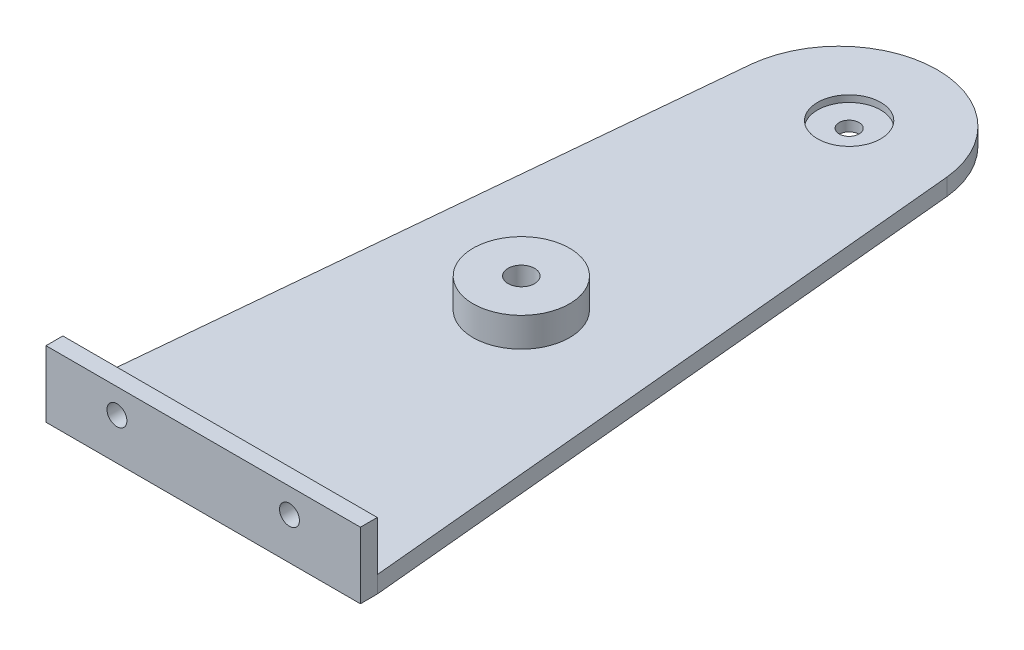
ISO-10303-21;
HEADER;
FILE_DESCRIPTION(('STEP AP214'),'2;1');
FILE_NAME('part.step','',(''),(''),'','','');
FILE_SCHEMA(('AUTOMOTIVE_DESIGN { 1 0 10303 214 1 1 1 1 }'));
ENDSEC;
DATA;
#1=APPLICATION_CONTEXT('core data for automotive mechanical design processes');
#2=APPLICATION_PROTOCOL_DEFINITION('international standard','automotive_design',2000,#1);
#3=PRODUCT_CONTEXT('',#1,'mechanical');
#4=PRODUCT('Part','Part','',(#3));
#5=PRODUCT_RELATED_PRODUCT_CATEGORY('part','',(#4));
#6=PRODUCT_DEFINITION_FORMATION('','',#4);
#7=PRODUCT_DEFINITION_CONTEXT('part definition',#1,'design');
#8=PRODUCT_DEFINITION('design','',#6,#7);
#9=PRODUCT_DEFINITION_SHAPE('','',#8);
#10=(LENGTH_UNIT() NAMED_UNIT(*) SI_UNIT(.MILLI.,.METRE.));
#11=(NAMED_UNIT(*) PLANE_ANGLE_UNIT() SI_UNIT($,.RADIAN.));
#12=(NAMED_UNIT(*) SI_UNIT($,.STERADIAN.) SOLID_ANGLE_UNIT());
#13=UNCERTAINTY_MEASURE_WITH_UNIT(LENGTH_MEASURE(1.E-05),#10,'distance_accuracy_value','');
#14=(GEOMETRIC_REPRESENTATION_CONTEXT(3) GLOBAL_UNCERTAINTY_ASSIGNED_CONTEXT((#13)) GLOBAL_UNIT_ASSIGNED_CONTEXT((#10,
#11,#12)) REPRESENTATION_CONTEXT('',''));
#15=CARTESIAN_POINT('',(0.,0.,0.));
#16=DIRECTION('',(0.,0.,1.));
#17=DIRECTION('',(1.,0.,0.));
#18=AXIS2_PLACEMENT_3D('',#15,#16,#17);
#19=CARTESIAN_POINT('',(0.,0.,0.));
#20=DIRECTION('',(0.,1.,0.));
#21=DIRECTION('',(0.,0.,1.));
#22=AXIS2_PLACEMENT_3D('',#19,#20,#21);
#23=PLANE('',#22);
#24=CARTESIAN_POINT('',(-0.0202063432006589,0.,49.3982763451399));
#25=DIRECTION('',(0.,1.,0.));
#26=DIRECTION('',(0.,0.,1.));
#27=AXIS2_PLACEMENT_3D('',#24,#25,#26);
#28=CIRCLE('',#27,7.26796940156826);
#29=CARTESIAN_POINT('',(-0.0202063432006589,0.,56.6662457467081));
#30=VERTEX_POINT('',#29);
#31=EDGE_CURVE('E11',#30,#30,#28,.T.);
#32=ORIENTED_EDGE('',*,*,#31,.F.);
#33=EDGE_LOOP('',(#32));
#34=FACE_BOUND('',#33,.T.);
#35=DIRECTION('',(0.0941057343410475,0.,0.995562208384856));
#36=VECTOR('',#35,1.);
#37=CARTESIAN_POINT('',(14.5881691243835,0.,-1.37894986026911));
#38=LINE('',#37,#36);
#39=CARTESIAN_POINT('',(14.7185146599283,0.,0.));
#40=VERTEX_POINT('',#39);
#41=CARTESIAN_POINT('',(23.6803571196277,0.,94.8090117233565));
#42=VERTEX_POINT('',#41);
#43=EDGE_CURVE('E125',#40,#42,#38,.T.);
#44=ORIENTED_EDGE('',*,*,#43,.F.);
#45=CARTESIAN_POINT('',(-0.0202063432006572,0.,1.53641351594778));
#46=DIRECTION('',(0.,1.,0.));
#47=DIRECTION('',(0.,0.,1.));
#48=AXIS2_PLACEMENT_3D('',#45,#46,#47);
#49=CIRCLE('',#48,14.8185850640357);
#50=CARTESIAN_POINT('',(-14.7589273463297,0.,0.));
#51=VERTEX_POINT('',#50);
#52=EDGE_CURVE('E127',#40,#51,#49,.T.);
#53=ORIENTED_EDGE('',*,*,#52,.T.);
#54=DIRECTION('',(-0.0938954260904472,0.,0.995582065406611));
#55=VECTOR('',#54,1.);
#56=CARTESIAN_POINT('',(-14.6288074618601,0.,-1.37967341674187));
#57=LINE('',#56,#55);
#58=CARTESIAN_POINT('',(-23.700563462829,0.,94.8090117233565));
#59=VERTEX_POINT('',#58);
#60=EDGE_CURVE('E143',#51,#59,#57,.T.);
#61=ORIENTED_EDGE('',*,*,#60,.T.);
#62=DIRECTION('',(-1.,0.,0.));
#63=VECTOR('',#62,1.);
#64=CARTESIAN_POINT('',(0.,0.,94.8090117233565));
#65=LINE('',#64,#63);
#66=EDGE_CURVE('E75',#42,#59,#65,.T.);
#67=ORIENTED_EDGE('',*,*,#66,.F.);
#68=EDGE_LOOP('',(#44,#53,#61,#67));
#69=FACE_BOUND('',#68,.T.);
#70=CARTESIAN_POINT('',(-0.0202063432006589,0.,0.));
#71=DIRECTION('',(0.,1.,0.));
#72=DIRECTION('',(0.,0.,1.));
#73=AXIS2_PLACEMENT_3D('',#70,#71,#72);
#74=CIRCLE('',#73,4.7625);
#75=CARTESIAN_POINT('',(-0.0202063432006589,0.,4.76250000000003));
#76=VERTEX_POINT('',#75);
#77=EDGE_CURVE('E228',#76,#76,#74,.F.);
#78=ORIENTED_EDGE('',*,*,#77,.T.);
#79=EDGE_LOOP('',(#78));
#80=FACE_BOUND('',#79,.T.);
#81=ADVANCED_FACE('F34',(#34,#69,#80),#23,.T.);
#82=CARTESIAN_POINT('',(-0.0202063432006589,-10.,0.));
#83=DIRECTION('',(0.,1.,0.));
#84=DIRECTION('',(0.,0.,1.));
#85=AXIS2_PLACEMENT_3D('',#82,#83,#84);
#86=CYLINDRICAL_SURFACE('',#85,1.5);
#87=CARTESIAN_POINT('',(-0.0202063432006589,-2.54,0.));
#88=DIRECTION('',(0.,1.,0.));
#89=DIRECTION('',(0.,0.,1.));
#90=AXIS2_PLACEMENT_3D('',#87,#88,#89);
#91=CIRCLE('',#90,1.5);
#92=CARTESIAN_POINT('',(-0.0202063432006589,-2.54,1.50000000000003));
#93=VERTEX_POINT('',#92);
#94=EDGE_CURVE('E239',#93,#93,#91,.F.);
#95=ORIENTED_EDGE('',*,*,#94,.T.);
#96=EDGE_LOOP('',(#95));
#97=FACE_BOUND('',#96,.T.);
#98=CARTESIAN_POINT('',(-0.0202063432006589,-1.,0.));
#99=DIRECTION('',(0.,1.,0.));
#100=DIRECTION('',(0.,0.,1.));
#101=AXIS2_PLACEMENT_3D('',#98,#99,#100);
#102=CIRCLE('',#101,1.5);
#103=CARTESIAN_POINT('',(-0.0202063432006589,-1.,1.50000000000003));
#104=VERTEX_POINT('',#103);
#105=EDGE_CURVE('E237',#104,#104,#102,.F.);
#106=ORIENTED_EDGE('',*,*,#105,.F.);
#107=EDGE_LOOP('',(#106));
#108=FACE_BOUND('',#107,.T.);
#109=ADVANCED_FACE('F166',(#97,#108),#86,.F.);
#110=CARTESIAN_POINT('',(14.5881691243835,-2.54,-1.37894986026911));
#111=DIRECTION('',(-0.995562208384856,0.,0.0941057343410474));
#112=DIRECTION('',(0.0941057343410475,0.,0.995562208384857));
#113=AXIS2_PLACEMENT_3D('',#110,#111,#112);
#114=PLANE('',#113);
#115=ORIENTED_EDGE('',*,*,#43,.T.);
#116=DIRECTION('',(0.,1.,0.));
#117=VECTOR('',#116,1.);
#118=CARTESIAN_POINT('',(23.6803571196277,-2.54,94.8090117233565));
#119=LINE('',#118,#117);
#120=CARTESIAN_POINT('',(23.6803571196277,-2.54,94.8090117233565));
#121=VERTEX_POINT('',#120);
#122=EDGE_CURVE('E43',#121,#42,#119,.T.);
#123=ORIENTED_EDGE('',*,*,#122,.F.);
#124=DIRECTION('',(0.0941057343410475,0.,0.995562208384856));
#125=VECTOR('',#124,1.);
#126=CARTESIAN_POINT('',(14.5881691243835,-2.54,-1.37894986026911));
#127=LINE('',#126,#125);
#128=CARTESIAN_POINT('',(14.7185146599283,-2.54,0.));
#129=VERTEX_POINT('',#128);
#130=EDGE_CURVE('E51',#129,#121,#127,.T.);
#131=ORIENTED_EDGE('',*,*,#130,.F.);
#132=DIRECTION('',(0.,1.,0.));
#133=VECTOR('',#132,1.);
#134=CARTESIAN_POINT('',(14.7185146599283,-2.54,0.));
#135=LINE('',#134,#133);
#136=EDGE_CURVE('E79',#129,#40,#135,.T.);
#137=ORIENTED_EDGE('',*,*,#136,.T.);
#138=EDGE_LOOP('',(#115,#123,#131,#137));
#139=FACE_BOUND('',#138,.T.);
#140=ADVANCED_FACE('F36',(#139),#114,.F.);
#141=CARTESIAN_POINT('',(-14.6288074618601,-2.54,-1.37967341674187));
#142=DIRECTION('',(-0.995582065406611,0.,-0.0938954260904472));
#143=DIRECTION('',(-0.0938954260904472,0.,0.995582065406611));
#144=AXIS2_PLACEMENT_3D('',#141,#142,#143);
#145=PLANE('',#144);
#146=ORIENTED_EDGE('',*,*,#60,.F.);
#147=DIRECTION('',(0.,1.,0.));
#148=VECTOR('',#147,1.);
#149=CARTESIAN_POINT('',(-14.7589273463297,-2.54,0.));
#150=LINE('',#149,#148);
#151=CARTESIAN_POINT('',(-14.7589273463297,-2.54,0.));
#152=VERTEX_POINT('',#151);
#153=EDGE_CURVE('E67',#152,#51,#150,.T.);
#154=ORIENTED_EDGE('',*,*,#153,.F.);
#155=DIRECTION('',(-0.0938954260904472,0.,0.995582065406611));
#156=VECTOR('',#155,1.);
#157=CARTESIAN_POINT('',(-14.6288074618601,-2.54,-1.37967341674187));
#158=LINE('',#157,#156);
#159=CARTESIAN_POINT('',(-23.700563462829,-2.54,94.8090117233565));
#160=VERTEX_POINT('',#159);
#161=EDGE_CURVE('E136',#152,#160,#158,.T.);
#162=ORIENTED_EDGE('',*,*,#161,.T.);
#163=DIRECTION('',(0.,1.,0.));
#164=VECTOR('',#163,1.);
#165=CARTESIAN_POINT('',(-23.700563462829,-2.54,94.8090117233565));
#166=LINE('',#165,#164);
#167=EDGE_CURVE('E147',#160,#59,#166,.T.);
#168=ORIENTED_EDGE('',*,*,#167,.T.);
#169=EDGE_LOOP('',(#146,#154,#162,#168));
#170=FACE_BOUND('',#169,.T.);
#171=ADVANCED_FACE('F156',(#170),#145,.T.);
#172=CARTESIAN_POINT('',(-0.0202063432006572,-2.54,1.53641351594778));
#173=DIRECTION('',(0.,1.,0.));
#174=DIRECTION('',(0.,0.,1.));
#175=AXIS2_PLACEMENT_3D('',#172,#173,#174);
#176=CYLINDRICAL_SURFACE('',#175,14.8185850640357);
#177=ORIENTED_EDGE('',*,*,#52,.F.);
#178=ORIENTED_EDGE('',*,*,#136,.F.);
#179=CARTESIAN_POINT('',(-0.0202063432006572,-2.54,1.53641351594778));
#180=DIRECTION('',(0.,1.,0.));
#181=DIRECTION('',(0.,0.,1.));
#182=AXIS2_PLACEMENT_3D('',#179,#180,#181);
#183=CIRCLE('',#182,14.8185850640357);
#184=EDGE_CURVE('E134',#129,#152,#183,.T.);
#185=ORIENTED_EDGE('',*,*,#184,.T.);
#186=ORIENTED_EDGE('',*,*,#153,.T.);
#187=EDGE_LOOP('',(#177,#178,#185,#186));
#188=FACE_BOUND('',#187,.T.);
#189=ADVANCED_FACE('F153',(#188),#176,.T.);
#190=CARTESIAN_POINT('',(-0.0202063432006589,-2.54,49.3982763451399));
#191=DIRECTION('',(0.,1.,0.));
#192=DIRECTION('',(0.,0.,1.));
#193=AXIS2_PLACEMENT_3D('',#190,#191,#192);
#194=CYLINDRICAL_SURFACE('',#193,1.99999994336487);
#195=CARTESIAN_POINT('',(-0.0202063432006589,-2.54,49.3982763451399));
#196=DIRECTION('',(0.,1.,0.));
#197=DIRECTION('',(0.,0.,1.));
#198=AXIS2_PLACEMENT_3D('',#195,#196,#197);
#199=CIRCLE('',#198,1.99999994336487);
#200=CARTESIAN_POINT('',(-0.0202063432006589,-2.54,51.3982762885047));
#201=VERTEX_POINT('',#200);
#202=EDGE_CURVE('E138',#201,#201,#199,.F.);
#203=ORIENTED_EDGE('',*,*,#202,.T.);
#204=EDGE_LOOP('',(#203));
#205=FACE_BOUND('',#204,.T.);
#206=CARTESIAN_POINT('',(-0.0202063432006589,4.420108,49.3982763451399));
#207=DIRECTION('',(0.,1.,0.));
#208=DIRECTION('',(0.,0.,1.));
#209=AXIS2_PLACEMENT_3D('',#206,#207,#208);
#210=CIRCLE('',#209,1.99999994336487);
#211=CARTESIAN_POINT('',(-0.0202063432006589,4.420108,51.3982762885047));
#212=VERTEX_POINT('',#211);
#213=EDGE_CURVE('E226',#212,#212,#210,.F.);
#214=ORIENTED_EDGE('',*,*,#213,.F.);
#215=EDGE_LOOP('',(#214));
#216=FACE_BOUND('',#215,.T.);
#217=ADVANCED_FACE('F155',(#205,#216),#194,.F.);
#218=CARTESIAN_POINT('',(0.,-2.54,0.));
#219=DIRECTION('',(0.,1.,0.));
#220=DIRECTION('',(0.,0.,1.));
#221=AXIS2_PLACEMENT_3D('',#218,#219,#220);
#222=PLANE('',#221);
#223=ORIENTED_EDGE('',*,*,#94,.F.);
#224=EDGE_LOOP('',(#223));
#225=FACE_BOUND('',#224,.T.);
#226=ORIENTED_EDGE('',*,*,#130,.T.);
#227=DIRECTION('',(0.,0.,-1.));
#228=VECTOR('',#227,1.);
#229=CARTESIAN_POINT('',(23.6803571196277,-2.54,97.3490117233565));
#230=LINE('',#229,#228);
#231=CARTESIAN_POINT('',(23.6803571196277,-2.54,97.3490117233565));
#232=VERTEX_POINT('',#231);
#233=EDGE_CURVE('E106',#232,#121,#230,.T.);
#234=ORIENTED_EDGE('',*,*,#233,.F.);
#235=DIRECTION('',(1.,0.,0.));
#236=VECTOR('',#235,1.);
#237=CARTESIAN_POINT('',(23.6803571196277,-2.54,97.3490117233565));
#238=LINE('',#237,#236);
#239=CARTESIAN_POINT('',(-23.700563462829,-2.54,97.3490117233565));
#240=VERTEX_POINT('',#239);
#241=EDGE_CURVE('E112',#240,#232,#238,.T.);
#242=ORIENTED_EDGE('',*,*,#241,.F.);
#243=DIRECTION('',(0.,0.,-1.));
#244=VECTOR('',#243,1.);
#245=CARTESIAN_POINT('',(-23.700563462829,-2.54,97.3490117233565));
#246=LINE('',#245,#244);
#247=EDGE_CURVE('E258',#240,#160,#246,.T.);
#248=ORIENTED_EDGE('',*,*,#247,.T.);
#249=ORIENTED_EDGE('',*,*,#161,.F.);
#250=ORIENTED_EDGE('',*,*,#184,.F.);
#251=EDGE_LOOP('',(#226,#234,#242,#248,#249,#250));
#252=FACE_BOUND('',#251,.T.);
#253=ORIENTED_EDGE('',*,*,#202,.F.);
#254=EDGE_LOOP('',(#253));
#255=FACE_BOUND('',#254,.T.);
#256=ADVANCED_FACE('F123',(#225,#252,#255),#222,.F.);
#257=CARTESIAN_POINT('',(0.,0.,97.3490117233565));
#258=DIRECTION('',(0.,0.,-1.));
#259=DIRECTION('',(-1.,0.,0.));
#260=AXIS2_PLACEMENT_3D('',#257,#258,#259);
#261=PLANE('',#260);
#262=ORIENTED_EDGE('',*,*,#241,.T.);
#263=DIRECTION('',(0.,1.,0.));
#264=VECTOR('',#263,1.);
#265=CARTESIAN_POINT('',(23.6803571196277,-2.54,97.3490117233565));
#266=LINE('',#265,#264);
#267=CARTESIAN_POINT('',(23.6803571196277,7.46,97.3490117233565));
#268=VERTEX_POINT('',#267);
#269=EDGE_CURVE('E102',#232,#268,#266,.T.);
#270=ORIENTED_EDGE('',*,*,#269,.T.);
#271=DIRECTION('',(-1.,0.,0.));
#272=VECTOR('',#271,1.);
#273=CARTESIAN_POINT('',(23.6803571196277,7.46,97.3490117233565));
#274=LINE('',#273,#272);
#275=CARTESIAN_POINT('',(-23.700563462829,7.46,97.3490117233565));
#276=VERTEX_POINT('',#275);
#277=EDGE_CURVE('E111',#268,#276,#274,.T.);
#278=ORIENTED_EDGE('',*,*,#277,.T.);
#279=DIRECTION('',(0.,-1.,0.));
#280=VECTOR('',#279,1.);
#281=CARTESIAN_POINT('',(-23.700563462829,-2.54,97.3490117233565));
#282=LINE('',#281,#280);
#283=EDGE_CURVE('E118',#276,#240,#282,.T.);
#284=ORIENTED_EDGE('',*,*,#283,.T.);
#285=EDGE_LOOP('',(#262,#270,#278,#284));
#286=FACE_BOUND('',#285,.T.);
#287=CARTESIAN_POINT('',(-13.0101031716007,3.73,97.3490117233565));
#288=DIRECTION('',(0.,0.,1.));
#289=DIRECTION('',(-1.,0.,0.));
#290=AXIS2_PLACEMENT_3D('',#287,#288,#289);
#291=CIRCLE('',#290,1.5);
#292=CARTESIAN_POINT('',(-14.5101031716007,3.73,97.3490117233565));
#293=VERTEX_POINT('',#292);
#294=EDGE_CURVE('E250',#293,#293,#291,.T.);
#295=ORIENTED_EDGE('',*,*,#294,.F.);
#296=EDGE_LOOP('',(#295));
#297=FACE_BOUND('',#296,.T.);
#298=CARTESIAN_POINT('',(12.9898968283993,3.73,97.3490117233565));
#299=DIRECTION('',(0.,0.,1.));
#300=DIRECTION('',(-1.,0.,0.));
#301=AXIS2_PLACEMENT_3D('',#298,#299,#300);
#302=CIRCLE('',#301,1.5);
#303=CARTESIAN_POINT('',(11.4898968283993,3.73,97.3490117233565));
#304=VERTEX_POINT('',#303);
#305=EDGE_CURVE('E244',#304,#304,#302,.T.);
#306=ORIENTED_EDGE('',*,*,#305,.F.);
#307=EDGE_LOOP('',(#306));
#308=FACE_BOUND('',#307,.T.);
#309=ADVANCED_FACE('F115',(#286,#297,#308),#261,.F.);
#310=CARTESIAN_POINT('',(0.,0.,94.8090117233565));
#311=DIRECTION('',(0.,0.,-1.));
#312=DIRECTION('',(-1.,0.,0.));
#313=AXIS2_PLACEMENT_3D('',#310,#311,#312);
#314=PLANE('',#313);
#315=CARTESIAN_POINT('',(-13.0101031716007,3.73,94.8090117233565));
#316=DIRECTION('',(0.,0.,1.));
#317=DIRECTION('',(-1.,0.,0.));
#318=AXIS2_PLACEMENT_3D('',#315,#316,#317);
#319=CIRCLE('',#318,1.5);
#320=CARTESIAN_POINT('',(-14.5101031716007,3.73,94.8090117233565));
#321=VERTEX_POINT('',#320);
#322=EDGE_CURVE('E247',#321,#321,#319,.T.);
#323=ORIENTED_EDGE('',*,*,#322,.T.);
#324=EDGE_LOOP('',(#323));
#325=FACE_BOUND('',#324,.T.);
#326=DIRECTION('',(0.,1.,0.));
#327=VECTOR('',#326,1.);
#328=CARTESIAN_POINT('',(23.6803571196277,-2.54,94.8090117233565));
#329=LINE('',#328,#327);
#330=CARTESIAN_POINT('',(23.6803571196277,7.46,94.8090117233565));
#331=VERTEX_POINT('',#330);
#332=EDGE_CURVE('E253',#42,#331,#329,.T.);
#333=ORIENTED_EDGE('',*,*,#332,.F.);
#334=ORIENTED_EDGE('',*,*,#66,.T.);
#335=DIRECTION('',(0.,-1.,0.));
#336=VECTOR('',#335,1.);
#337=CARTESIAN_POINT('',(-23.700563462829,-2.54,94.8090117233565));
#338=LINE('',#337,#336);
#339=CARTESIAN_POINT('',(-23.700563462829,7.46,94.8090117233565));
#340=VERTEX_POINT('',#339);
#341=EDGE_CURVE('E121',#340,#59,#338,.T.);
#342=ORIENTED_EDGE('',*,*,#341,.F.);
#343=DIRECTION('',(-1.,0.,0.));
#344=VECTOR('',#343,1.);
#345=CARTESIAN_POINT('',(23.6803571196277,7.46,94.8090117233565));
#346=LINE('',#345,#344);
#347=EDGE_CURVE('E260',#331,#340,#346,.T.);
#348=ORIENTED_EDGE('',*,*,#347,.F.);
#349=EDGE_LOOP('',(#333,#334,#342,#348));
#350=FACE_BOUND('',#349,.T.);
#351=CARTESIAN_POINT('',(12.9898968283993,3.73,94.8090117233565));
#352=DIRECTION('',(0.,0.,1.));
#353=DIRECTION('',(-1.,0.,0.));
#354=AXIS2_PLACEMENT_3D('',#351,#352,#353);
#355=CIRCLE('',#354,1.5);
#356=CARTESIAN_POINT('',(11.4898968283993,3.73,94.8090117233565));
#357=VERTEX_POINT('',#356);
#358=EDGE_CURVE('E243',#357,#357,#355,.T.);
#359=ORIENTED_EDGE('',*,*,#358,.T.);
#360=EDGE_LOOP('',(#359));
#361=FACE_BOUND('',#360,.T.);
#362=ADVANCED_FACE('F182',(#325,#350,#361),#314,.T.);
#363=CARTESIAN_POINT('',(23.6803571196277,-2.54,97.3490117233565));
#364=DIRECTION('',(-1.,0.,0.));
#365=DIRECTION('',(0.,0.,1.));
#366=AXIS2_PLACEMENT_3D('',#363,#364,#365);
#367=PLANE('',#366);
#368=ORIENTED_EDGE('',*,*,#122,.T.);
#369=ORIENTED_EDGE('',*,*,#332,.T.);
#370=DIRECTION('',(0.,0.,-1.));
#371=VECTOR('',#370,1.);
#372=CARTESIAN_POINT('',(23.6803571196277,7.46,97.3490117233565));
#373=LINE('',#372,#371);
#374=EDGE_CURVE('E108',#268,#331,#373,.T.);
#375=ORIENTED_EDGE('',*,*,#374,.F.);
#376=ORIENTED_EDGE('',*,*,#269,.F.);
#377=ORIENTED_EDGE('',*,*,#233,.T.);
#378=EDGE_LOOP('',(#368,#369,#375,#376,#377));
#379=FACE_BOUND('',#378,.T.);
#380=ADVANCED_FACE('F105',(#379),#367,.F.);
#381=CARTESIAN_POINT('',(23.6803571196277,7.46,97.3490117233565));
#382=DIRECTION('',(0.,-1.,0.));
#383=DIRECTION('',(0.,0.,-1.));
#384=AXIS2_PLACEMENT_3D('',#381,#382,#383);
#385=PLANE('',#384);
#386=ORIENTED_EDGE('',*,*,#347,.T.);
#387=DIRECTION('',(0.,0.,-1.));
#388=VECTOR('',#387,1.);
#389=CARTESIAN_POINT('',(-23.700563462829,7.46,97.3490117233565));
#390=LINE('',#389,#388);
#391=EDGE_CURVE('E129',#276,#340,#390,.T.);
#392=ORIENTED_EDGE('',*,*,#391,.F.);
#393=ORIENTED_EDGE('',*,*,#277,.F.);
#394=ORIENTED_EDGE('',*,*,#374,.T.);
#395=EDGE_LOOP('',(#386,#392,#393,#394));
#396=FACE_BOUND('',#395,.T.);
#397=ADVANCED_FACE('F181',(#396),#385,.F.);
#398=CARTESIAN_POINT('',(-23.700563462829,-2.54,97.3490117233565));
#399=DIRECTION('',(1.,0.,0.));
#400=DIRECTION('',(0.,0.,-1.));
#401=AXIS2_PLACEMENT_3D('',#398,#399,#400);
#402=PLANE('',#401);
#403=ORIENTED_EDGE('',*,*,#341,.T.);
#404=ORIENTED_EDGE('',*,*,#167,.F.);
#405=ORIENTED_EDGE('',*,*,#247,.F.);
#406=ORIENTED_EDGE('',*,*,#283,.F.);
#407=ORIENTED_EDGE('',*,*,#391,.T.);
#408=EDGE_LOOP('',(#403,#404,#405,#406,#407));
#409=FACE_BOUND('',#408,.T.);
#410=ADVANCED_FACE('F185',(#409),#402,.F.);
#411=CARTESIAN_POINT('',(-13.0101031716007,3.73,97.3490117233565));
#412=DIRECTION('',(0.,0.,-1.));
#413=DIRECTION('',(-1.,0.,0.));
#414=AXIS2_PLACEMENT_3D('',#411,#412,#413);
#415=CYLINDRICAL_SURFACE('',#414,1.5);
#416=ORIENTED_EDGE('',*,*,#294,.T.);
#417=EDGE_LOOP('',(#416));
#418=FACE_BOUND('',#417,.T.);
#419=ORIENTED_EDGE('',*,*,#322,.F.);
#420=EDGE_LOOP('',(#419));
#421=FACE_BOUND('',#420,.T.);
#422=ADVANCED_FACE('F189',(#418,#421),#415,.F.);
#423=CARTESIAN_POINT('',(12.9898968283993,3.73,97.3490117233565));
#424=DIRECTION('',(0.,0.,-1.));
#425=DIRECTION('',(-1.,0.,0.));
#426=AXIS2_PLACEMENT_3D('',#423,#424,#425);
#427=CYLINDRICAL_SURFACE('',#426,1.5);
#428=ORIENTED_EDGE('',*,*,#305,.T.);
#429=EDGE_LOOP('',(#428));
#430=FACE_BOUND('',#429,.T.);
#431=ORIENTED_EDGE('',*,*,#358,.F.);
#432=EDGE_LOOP('',(#431));
#433=FACE_BOUND('',#432,.T.);
#434=ADVANCED_FACE('F198',(#430,#433),#427,.F.);
#435=CARTESIAN_POINT('',(-0.0202063432006589,-1.,0.));
#436=DIRECTION('',(0.,1.,0.));
#437=DIRECTION('',(0.,0.,1.));
#438=AXIS2_PLACEMENT_3D('',#435,#436,#437);
#439=CYLINDRICAL_SURFACE('',#438,4.7625);
#440=CARTESIAN_POINT('',(-0.0202063432006589,-1.,0.));
#441=DIRECTION('',(0.,1.,0.));
#442=DIRECTION('',(0.,0.,1.));
#443=AXIS2_PLACEMENT_3D('',#440,#441,#442);
#444=CIRCLE('',#443,4.7625);
#445=CARTESIAN_POINT('',(-0.0202063432006589,-1.,4.76250000000003));
#446=VERTEX_POINT('',#445);
#447=EDGE_CURVE('E231',#446,#446,#444,.F.);
#448=ORIENTED_EDGE('',*,*,#447,.T.);
#449=EDGE_LOOP('',(#448));
#450=FACE_BOUND('',#449,.T.);
#451=ORIENTED_EDGE('',*,*,#77,.F.);
#452=EDGE_LOOP('',(#451));
#453=FACE_BOUND('',#452,.T.);
#454=ADVANCED_FACE('F201',(#450,#453),#439,.F.);
#455=CARTESIAN_POINT('',(0.,-1.,0.));
#456=DIRECTION('',(0.,1.,0.));
#457=DIRECTION('',(0.,0.,1.));
#458=AXIS2_PLACEMENT_3D('',#455,#456,#457);
#459=PLANE('',#458);
#460=ORIENTED_EDGE('',*,*,#447,.F.);
#461=EDGE_LOOP('',(#460));
#462=FACE_BOUND('',#461,.T.);
#463=ORIENTED_EDGE('',*,*,#105,.T.);
#464=EDGE_LOOP('',(#463));
#465=FACE_BOUND('',#464,.T.);
#466=ADVANCED_FACE('F206',(#462,#465),#459,.T.);
#467=CARTESIAN_POINT('',(-0.0202063432006589,4.420108,49.3982763451399));
#468=DIRECTION('',(0.,-1.,0.));
#469=DIRECTION('',(0.,0.,-1.));
#470=AXIS2_PLACEMENT_3D('',#467,#468,#469);
#471=CYLINDRICAL_SURFACE('',#470,7.26796940156826);
#472=CARTESIAN_POINT('',(-0.0202063432006589,4.420108,49.3982763451399));
#473=DIRECTION('',(0.,1.,0.));
#474=DIRECTION('',(0.,0.,1.));
#475=AXIS2_PLACEMENT_3D('',#472,#473,#474);
#476=CIRCLE('',#475,7.26796940156826);
#477=CARTESIAN_POINT('',(-0.0202063432006589,4.420108,56.6662457467081));
#478=VERTEX_POINT('',#477);
#479=EDGE_CURVE('E223',#478,#478,#476,.F.);
#480=ORIENTED_EDGE('',*,*,#479,.T.);
#481=EDGE_LOOP('',(#480));
#482=FACE_BOUND('',#481,.T.);
#483=ORIENTED_EDGE('',*,*,#31,.T.);
#484=EDGE_LOOP('',(#483));
#485=FACE_BOUND('',#484,.T.);
#486=ADVANCED_FACE('F210',(#482,#485),#471,.T.);
#487=CARTESIAN_POINT('',(0.,4.420108,0.));
#488=DIRECTION('',(0.,1.,0.));
#489=DIRECTION('',(0.,0.,1.));
#490=AXIS2_PLACEMENT_3D('',#487,#488,#489);
#491=PLANE('',#490);
#492=ORIENTED_EDGE('',*,*,#479,.F.);
#493=EDGE_LOOP('',(#492));
#494=FACE_BOUND('',#493,.T.);
#495=ORIENTED_EDGE('',*,*,#213,.T.);
#496=EDGE_LOOP('',(#495));
#497=FACE_BOUND('',#496,.T.);
#498=ADVANCED_FACE('F214',(#494,#497),#491,.T.);
#499=CLOSED_SHELL('',(#81,#109,#140,#171,#189,#217,#256,#309,#362,#380,#397,#410,#422,#434,#454,
#466,#486,#498));
#500=MANIFOLD_SOLID_BREP('B2',#499);
#501=ADVANCED_BREP_SHAPE_REPRESENTATION('',(#18,#500),#14);
#502=SHAPE_DEFINITION_REPRESENTATION(#9,#501);
ENDSEC;
END-ISO-10303-21;
